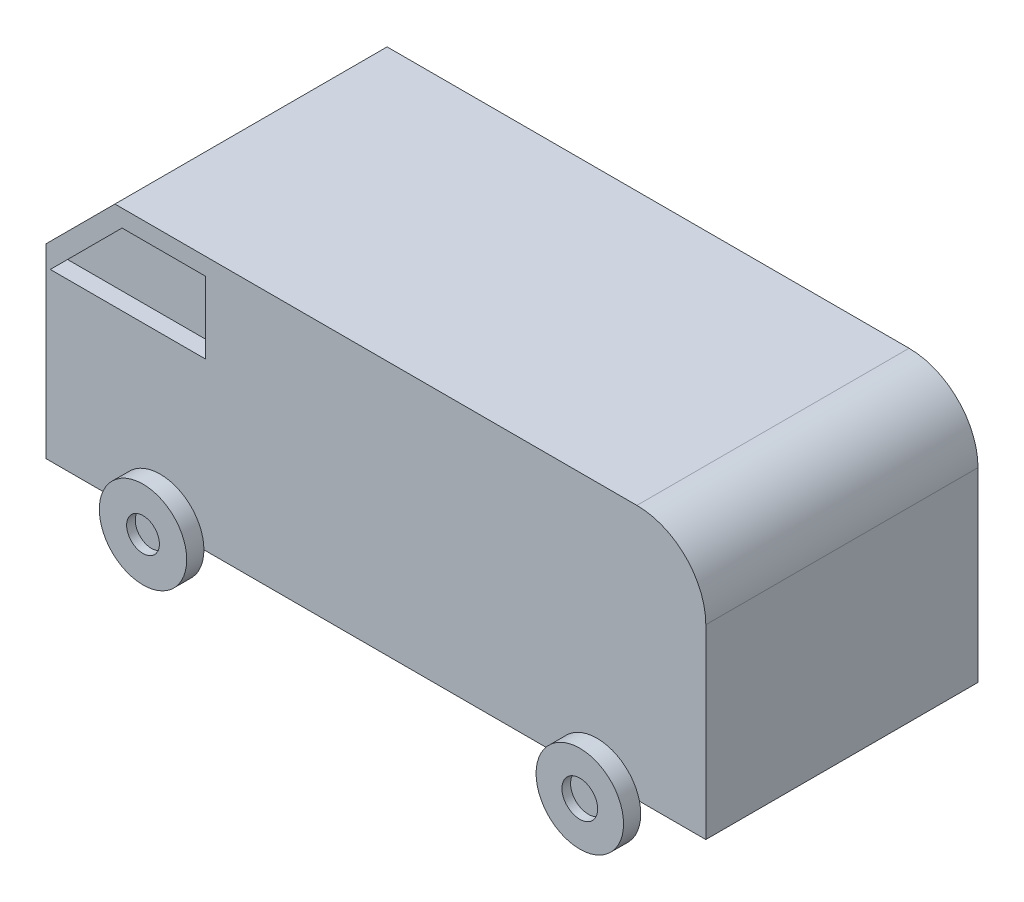
ISO-10303-21;
HEADER;
FILE_DESCRIPTION(('STEP AP214'),'2;1');
FILE_NAME('part.step','',(''),(''),'','','');
FILE_SCHEMA(('AUTOMOTIVE_DESIGN { 1 0 10303 214 1 1 1 1 }'));
ENDSEC;
DATA;
#1=APPLICATION_CONTEXT('core data for automotive mechanical design processes');
#2=APPLICATION_PROTOCOL_DEFINITION('international standard','automotive_design',2000,#1);
#3=PRODUCT_CONTEXT('',#1,'mechanical');
#4=PRODUCT('Part','Part','',(#3));
#5=PRODUCT_RELATED_PRODUCT_CATEGORY('part','',(#4));
#6=PRODUCT_DEFINITION_FORMATION('','',#4);
#7=PRODUCT_DEFINITION_CONTEXT('part definition',#1,'design');
#8=PRODUCT_DEFINITION('design','',#6,#7);
#9=PRODUCT_DEFINITION_SHAPE('','',#8);
#10=(LENGTH_UNIT() NAMED_UNIT(*) SI_UNIT(.MILLI.,.METRE.));
#11=(NAMED_UNIT(*) PLANE_ANGLE_UNIT() SI_UNIT($,.RADIAN.));
#12=(NAMED_UNIT(*) SI_UNIT($,.STERADIAN.) SOLID_ANGLE_UNIT());
#13=UNCERTAINTY_MEASURE_WITH_UNIT(LENGTH_MEASURE(1.E-05),#10,'distance_accuracy_value','');
#14=(GEOMETRIC_REPRESENTATION_CONTEXT(3) GLOBAL_UNCERTAINTY_ASSIGNED_CONTEXT((#13)) GLOBAL_UNIT_ASSIGNED_CONTEXT((#10,
#11,#12)) REPRESENTATION_CONTEXT('',''));
#15=CARTESIAN_POINT('',(0.,0.,0.));
#16=DIRECTION('',(0.,0.,1.));
#17=DIRECTION('',(1.,0.,0.));
#18=AXIS2_PLACEMENT_3D('',#15,#16,#17);
#19=CARTESIAN_POINT('',(121.13815337085,0.,89.));
#20=DIRECTION('',(0.,0.,-1.));
#21=DIRECTION('',(-1.,0.,0.));
#22=AXIS2_PLACEMENT_3D('',#19,#20,#21);
#23=CYLINDRICAL_SURFACE('',#22,0.0789375693557303);
#24=CARTESIAN_POINT('',(121.13815337085,0.,79.));
#25=DIRECTION('',(0.,0.,1.));
#26=DIRECTION('',(1.,0.,0.));
#27=AXIS2_PLACEMENT_3D('',#24,#25,#26);
#28=CIRCLE('',#27,0.0789375693557303);
#29=CARTESIAN_POINT('',(121.217090940206,0.,79.));
#30=VERTEX_POINT('',#29);
#31=CARTESIAN_POINT('',(121.059215801495,0.,79.));
#32=VERTEX_POINT('',#31);
#33=EDGE_CURVE('E190',#30,#32,#28,.T.);
#34=ORIENTED_EDGE('',*,*,#33,.F.);
#35=EDGE_CURVE('E186',#32,#30,#28,.T.);
#36=ORIENTED_EDGE('',*,*,#35,.F.);
#37=EDGE_LOOP('',(#34,#36));
#38=FACE_BOUND('',#37,.T.);
#39=CARTESIAN_POINT('',(121.13815337085,0.,84.));
#40=DIRECTION('',(0.,0.,1.));
#41=DIRECTION('',(1.,0.,0.));
#42=AXIS2_PLACEMENT_3D('',#39,#40,#41);
#43=CIRCLE('',#42,0.0789375693557303);
#44=CARTESIAN_POINT('',(121.217090940206,0.,84.));
#45=VERTEX_POINT('',#44);
#46=EDGE_CURVE('E43',#45,#45,#43,.T.);
#47=ORIENTED_EDGE('',*,*,#46,.T.);
#48=EDGE_LOOP('',(#47));
#49=FACE_BOUND('',#48,.T.);
#50=ADVANCED_FACE('F39',(#38,#49),#23,.F.);
#51=CARTESIAN_POINT('',(-191.5,148.,79.));
#52=DIRECTION('',(0.,0.,-1.));
#53=DIRECTION('',(-1.,0.,0.));
#54=AXIS2_PLACEMENT_3D('',#51,#52,#53);
#55=PLANE('',#54);
#56=DIRECTION('',(1.,0.,0.));
#57=VECTOR('',#56,1.);
#58=CARTESIAN_POINT('',(-191.5,0.,79.));
#59=LINE('',#58,#57);
#60=EDGE_CURVE('E353',#32,#30,#59,.T.);
#61=ORIENTED_EDGE('',*,*,#60,.T.);
#62=ORIENTED_EDGE('',*,*,#33,.T.);
#63=EDGE_LOOP('',(#61,#62));
#64=FACE_BOUND('',#63,.T.);
#65=ADVANCED_FACE('F401',(#64),#55,.F.);
#66=CARTESIAN_POINT('',(191.5,148.,79.));
#67=DIRECTION('',(-1.,0.,0.));
#68=DIRECTION('',(0.,0.,1.));
#69=AXIS2_PLACEMENT_3D('',#66,#67,#68);
#70=PLANE('',#69);
#71=DIRECTION('',(0.,-1.,0.));
#72=VECTOR('',#71,1.);
#73=CARTESIAN_POINT('',(191.5,148.,-79.));
#74=LINE('',#73,#72);
#75=CARTESIAN_POINT('',(191.5,108.,-79.));
#76=VERTEX_POINT('',#75);
#77=CARTESIAN_POINT('',(191.5,0.,-79.));
#78=VERTEX_POINT('',#77);
#79=EDGE_CURVE('E285',#76,#78,#74,.T.);
#80=ORIENTED_EDGE('',*,*,#79,.F.);
#81=DIRECTION('',(0.,0.,-1.));
#82=VECTOR('',#81,1.);
#83=CARTESIAN_POINT('',(191.5,108.,79.));
#84=LINE('',#83,#82);
#85=CARTESIAN_POINT('',(191.5,108.,79.));
#86=VERTEX_POINT('',#85);
#87=EDGE_CURVE('E309',#76,#86,#84,.F.);
#88=ORIENTED_EDGE('',*,*,#87,.T.);
#89=DIRECTION('',(0.,-1.,0.));
#90=VECTOR('',#89,1.);
#91=CARTESIAN_POINT('',(191.5,148.,79.));
#92=LINE('',#91,#90);
#93=CARTESIAN_POINT('',(191.5,0.,79.));
#94=VERTEX_POINT('',#93);
#95=EDGE_CURVE('E264',#86,#94,#92,.T.);
#96=ORIENTED_EDGE('',*,*,#95,.T.);
#97=DIRECTION('',(0.,0.,-1.));
#98=VECTOR('',#97,1.);
#99=CARTESIAN_POINT('',(191.5,0.,79.));
#100=LINE('',#99,#98);
#101=EDGE_CURVE('E156',#94,#78,#100,.T.);
#102=ORIENTED_EDGE('',*,*,#101,.T.);
#103=EDGE_LOOP('',(#80,#88,#96,#102));
#104=FACE_BOUND('',#103,.T.);
#105=ADVANCED_FACE('F345',(#104),#70,.F.);
#106=CARTESIAN_POINT('',(-191.5,148.,-79.));
#107=DIRECTION('',(0.,0.,1.));
#108=DIRECTION('',(1.,0.,0.));
#109=AXIS2_PLACEMENT_3D('',#106,#107,#108);
#110=PLANE('',#109);
#111=CARTESIAN_POINT('',(-116.282098448064,0.,-79.));
#112=DIRECTION('',(0.,0.,-1.));
#113=DIRECTION('',(-1.,0.,0.));
#114=AXIS2_PLACEMENT_3D('',#111,#112,#113);
#115=CIRCLE('',#114,25.1402396602186);
#116=CARTESIAN_POINT('',(-141.422338108282,0.,-79.));
#117=VERTEX_POINT('',#116);
#118=CARTESIAN_POINT('',(-91.1418587878454,0.,-79.));
#119=VERTEX_POINT('',#118);
#120=EDGE_CURVE('E160',#117,#119,#115,.T.);
#121=ORIENTED_EDGE('',*,*,#120,.F.);
#122=DIRECTION('',(-1.,0.,0.));
#123=VECTOR('',#122,1.);
#124=CARTESIAN_POINT('',(-191.5,0.,-79.));
#125=LINE('',#124,#123);
#126=CARTESIAN_POINT('',(-191.5,0.,-79.));
#127=VERTEX_POINT('',#126);
#128=EDGE_CURVE('E146',#117,#127,#125,.T.);
#129=ORIENTED_EDGE('',*,*,#128,.T.);
#130=DIRECTION('',(0.,-1.,0.));
#131=VECTOR('',#130,1.);
#132=CARTESIAN_POINT('',(-191.5,148.,-79.));
#133=LINE('',#132,#131);
#134=CARTESIAN_POINT('',(-191.5,108.,-79.));
#135=VERTEX_POINT('',#134);
#136=EDGE_CURVE('E282',#135,#127,#133,.T.);
#137=ORIENTED_EDGE('',*,*,#136,.F.);
#138=DIRECTION('',(-0.707106781186548,-0.707106781186548,0.));
#139=VECTOR('',#138,1.);
#140=CARTESIAN_POINT('',(-151.5,148.,-79.));
#141=LINE('',#140,#139);
#142=CARTESIAN_POINT('',(-151.5,148.,-79.));
#143=VERTEX_POINT('',#142);
#144=EDGE_CURVE('E298',#135,#143,#141,.F.);
#145=ORIENTED_EDGE('',*,*,#144,.T.);
#146=DIRECTION('',(-1.,0.,0.));
#147=VECTOR('',#146,1.);
#148=CARTESIAN_POINT('',(-191.5,148.,-79.));
#149=LINE('',#148,#147);
#150=CARTESIAN_POINT('',(151.5,148.,-79.));
#151=VERTEX_POINT('',#150);
#152=EDGE_CURVE('E256',#151,#143,#149,.T.);
#153=ORIENTED_EDGE('',*,*,#152,.F.);
#154=CARTESIAN_POINT('',(151.5,108.,-79.));
#155=DIRECTION('',(0.,0.,1.));
#156=DIRECTION('',(1.,0.,0.));
#157=AXIS2_PLACEMENT_3D('',#154,#155,#156);
#158=CIRCLE('',#157,40.);
#159=EDGE_CURVE('E306',#151,#76,#158,.F.);
#160=ORIENTED_EDGE('',*,*,#159,.T.);
#161=ORIENTED_EDGE('',*,*,#79,.T.);
#162=CARTESIAN_POINT('',(157.922480649683,0.,-79.));
#163=VERTEX_POINT('',#162);
#164=EDGE_CURVE('E158',#78,#163,#125,.T.);
#165=ORIENTED_EDGE('',*,*,#164,.T.);
#166=CARTESIAN_POINT('',(132.542849771646,0.,-79.));
#167=DIRECTION('',(0.,0.,-1.));
#168=DIRECTION('',(-1.,0.,0.));
#169=AXIS2_PLACEMENT_3D('',#166,#167,#168);
#170=CIRCLE('',#169,25.3796308780376);
#171=CARTESIAN_POINT('',(107.163218893608,0.,-79.));
#172=VERTEX_POINT('',#171);
#173=EDGE_CURVE('E63',#172,#163,#170,.T.);
#174=ORIENTED_EDGE('',*,*,#173,.F.);
#175=EDGE_CURVE('E162',#172,#119,#125,.T.);
#176=ORIENTED_EDGE('',*,*,#175,.T.);
#177=EDGE_LOOP('',(#121,#129,#137,#145,#153,#160,#161,#165,#174,#176));
#178=FACE_BOUND('',#177,.T.);
#179=ADVANCED_FACE('F161',(#178),#110,.F.);
#180=CARTESIAN_POINT('',(-191.5,148.,79.));
#181=DIRECTION('',(1.,0.,0.));
#182=DIRECTION('',(0.,0.,-1.));
#183=AXIS2_PLACEMENT_3D('',#180,#181,#182);
#184=PLANE('',#183);
#185=CARTESIAN_POINT('',(-191.5,34.6704726791085,30.2804457082857));
#186=DIRECTION('',(1.,0.,0.));
#187=DIRECTION('',(0.,0.,-1.));
#188=AXIS2_PLACEMENT_3D('',#185,#186,#187);
#189=CIRCLE('',#188,16.2323764534416);
#190=CARTESIAN_POINT('',(-191.5,34.6704726791085,14.0480692548441));
#191=VERTEX_POINT('',#190);
#192=EDGE_CURVE('E11',#191,#191,#189,.F.);
#193=ORIENTED_EDGE('',*,*,#192,.F.);
#194=EDGE_LOOP('',(#193));
#195=FACE_BOUND('',#194,.T.);
#196=CARTESIAN_POINT('',(-191.5,34.6704726791085,-53.7194885195902));
#197=DIRECTION('',(1.,0.,0.));
#198=DIRECTION('',(0.,0.,-1.));
#199=AXIS2_PLACEMENT_3D('',#196,#197,#198);
#200=CIRCLE('',#199,14.3227624030982);
#201=CARTESIAN_POINT('',(-191.5,34.6704726791085,-68.0422509226884));
#202=VERTEX_POINT('',#201);
#203=EDGE_CURVE('E49',#202,#202,#200,.F.);
#204=ORIENTED_EDGE('',*,*,#203,.F.);
#205=EDGE_LOOP('',(#204));
#206=FACE_BOUND('',#205,.T.);
#207=DIRECTION('',(0.,-1.,0.));
#208=VECTOR('',#207,1.);
#209=CARTESIAN_POINT('',(-191.5,148.,79.));
#210=LINE('',#209,#208);
#211=CARTESIAN_POINT('',(-191.5,108.,79.));
#212=VERTEX_POINT('',#211);
#213=CARTESIAN_POINT('',(-191.5,0.,79.));
#214=VERTEX_POINT('',#213);
#215=EDGE_CURVE('E279',#212,#214,#210,.T.);
#216=ORIENTED_EDGE('',*,*,#215,.F.);
#217=DIRECTION('',(0.,0.,-1.));
#218=VECTOR('',#217,1.);
#219=CARTESIAN_POINT('',(-191.5,108.,79.));
#220=LINE('',#219,#218);
#221=EDGE_CURVE('E295',#212,#135,#220,.T.);
#222=ORIENTED_EDGE('',*,*,#221,.T.);
#223=ORIENTED_EDGE('',*,*,#136,.T.);
#224=DIRECTION('',(0.,0.,1.));
#225=VECTOR('',#224,1.);
#226=CARTESIAN_POINT('',(-191.5,0.,79.));
#227=LINE('',#226,#225);
#228=EDGE_CURVE('E152',#127,#214,#227,.T.);
#229=ORIENTED_EDGE('',*,*,#228,.T.);
#230=EDGE_LOOP('',(#216,#222,#223,#229));
#231=FACE_BOUND('',#230,.T.);
#232=ADVANCED_FACE('F321',(#195,#206,#231),#184,.F.);
#233=CARTESIAN_POINT('',(128.35908528128,-6.01772290961608,79.));
#234=DIRECTION('',(0.,0.,1.));
#235=DIRECTION('',(1.,0.,0.));
#236=AXIS2_PLACEMENT_3D('',#233,#234,#235);
#237=CIRCLE('',#236,25.3835482797886);
#238=CARTESIAN_POINT('',(153.019002845121,0.,79.));
#239=VERTEX_POINT('',#238);
#240=CARTESIAN_POINT('',(103.699167717439,0.,79.));
#241=VERTEX_POINT('',#240);
#242=EDGE_CURVE('E200',#239,#241,#237,.T.);
#243=ORIENTED_EDGE('',*,*,#242,.F.);
#244=EDGE_CURVE('E272',#239,#94,#59,.T.);
#245=ORIENTED_EDGE('',*,*,#244,.T.);
#246=ORIENTED_EDGE('',*,*,#95,.F.);
#247=CARTESIAN_POINT('',(151.5,108.,79.));
#248=DIRECTION('',(0.,0.,-1.));
#249=DIRECTION('',(-1.,0.,0.));
#250=AXIS2_PLACEMENT_3D('',#247,#248,#249);
#251=CIRCLE('',#250,40.);
#252=CARTESIAN_POINT('',(151.5,148.,79.));
#253=VERTEX_POINT('',#252);
#254=EDGE_CURVE('E312',#86,#253,#251,.F.);
#255=ORIENTED_EDGE('',*,*,#254,.T.);
#256=DIRECTION('',(1.,0.,0.));
#257=VECTOR('',#256,1.);
#258=CARTESIAN_POINT('',(-191.5,148.,79.));
#259=LINE('',#258,#257);
#260=CARTESIAN_POINT('',(-151.5,148.,79.));
#261=VERTEX_POINT('',#260);
#262=EDGE_CURVE('E259',#261,#253,#259,.T.);
#263=ORIENTED_EDGE('',*,*,#262,.F.);
#264=DIRECTION('',(0.707106781186548,0.707106781186548,0.));
#265=VECTOR('',#264,1.);
#266=CARTESIAN_POINT('',(-151.5,148.,79.));
#267=LINE('',#266,#265);
#268=EDGE_CURVE('E292',#261,#212,#267,.F.);
#269=ORIENTED_EDGE('',*,*,#268,.T.);
#270=ORIENTED_EDGE('',*,*,#215,.T.);
#271=CARTESIAN_POINT('',(-150.549077837624,0.,79.));
#272=VERTEX_POINT('',#271);
#273=EDGE_CURVE('E260',#214,#272,#59,.T.);
#274=ORIENTED_EDGE('',*,*,#273,.T.);
#275=CARTESIAN_POINT('',(-125.190072903536,0.,79.));
#276=DIRECTION('',(0.,0.,1.));
#277=DIRECTION('',(1.,0.,0.));
#278=AXIS2_PLACEMENT_3D('',#275,#276,#277);
#279=CIRCLE('',#278,25.3590049340886);
#280=CARTESIAN_POINT('',(-99.831067969447,0.,79.));
#281=VERTEX_POINT('',#280);
#282=EDGE_CURVE('E209',#281,#272,#279,.T.);
#283=ORIENTED_EDGE('',*,*,#282,.F.);
#284=EDGE_CURVE('E364',#281,#241,#59,.T.);
#285=ORIENTED_EDGE('',*,*,#284,.T.);
#286=EDGE_LOOP('',(#243,#245,#246,#255,#263,#269,#270,#274,#283,#285));
#287=FACE_BOUND('',#286,.T.);
#288=DIRECTION('',(-1.,0.,0.));
#289=VECTOR('',#288,1.);
#290=CARTESIAN_POINT('',(0.,138.,79.));
#291=LINE('',#290,#289);
#292=CARTESIAN_POINT('',(-98.9978643762689,138.,79.));
#293=VERTEX_POINT('',#292);
#294=CARTESIAN_POINT('',(-147.357864376269,138.,79.));
#295=VERTEX_POINT('',#294);
#296=EDGE_CURVE('E233',#293,#295,#291,.T.);
#297=ORIENTED_EDGE('',*,*,#296,.F.);
#298=DIRECTION('',(0.,1.,0.));
#299=VECTOR('',#298,1.);
#300=CARTESIAN_POINT('',(-98.9978643762689,0.,79.));
#301=LINE('',#300,#299);
#302=CARTESIAN_POINT('',(-98.9978643762689,96.36,79.));
#303=VERTEX_POINT('',#302);
#304=EDGE_CURVE('E208',#303,#293,#301,.T.);
#305=ORIENTED_EDGE('',*,*,#304,.F.);
#306=DIRECTION('',(1.,0.,0.));
#307=VECTOR('',#306,1.);
#308=CARTESIAN_POINT('',(0.,96.36,79.));
#309=LINE('',#308,#307);
#310=CARTESIAN_POINT('',(-188.997864376269,96.36,79.));
#311=VERTEX_POINT('',#310);
#312=EDGE_CURVE('E218',#311,#303,#309,.T.);
#313=ORIENTED_EDGE('',*,*,#312,.F.);
#314=DIRECTION('',(-0.707106781186548,-0.707106781186548,0.));
#315=VECTOR('',#314,1.);
#316=CARTESIAN_POINT('',(-142.678932188134,142.678932188134,79.));
#317=LINE('',#316,#315);
#318=EDGE_CURVE('E237',#295,#311,#317,.T.);
#319=ORIENTED_EDGE('',*,*,#318,.F.);
#320=EDGE_LOOP('',(#297,#305,#313,#319));
#321=FACE_BOUND('',#320,.T.);
#322=ADVANCED_FACE('F324',(#287,#321),#55,.F.);
#323=CARTESIAN_POINT('',(0.,148.,0.));
#324=DIRECTION('',(0.,-1.,0.));
#325=DIRECTION('',(0.,0.,-1.));
#326=AXIS2_PLACEMENT_3D('',#323,#324,#325);
#327=PLANE('',#326);
#328=ORIENTED_EDGE('',*,*,#262,.T.);
#329=DIRECTION('',(0.,0.,-1.));
#330=VECTOR('',#329,1.);
#331=CARTESIAN_POINT('',(151.5,148.,0.));
#332=LINE('',#331,#330);
#333=EDGE_CURVE('E302',#253,#151,#332,.T.);
#334=ORIENTED_EDGE('',*,*,#333,.T.);
#335=ORIENTED_EDGE('',*,*,#152,.T.);
#336=DIRECTION('',(0.,0.,1.));
#337=VECTOR('',#336,1.);
#338=CARTESIAN_POINT('',(-151.5,148.,0.));
#339=LINE('',#338,#337);
#340=EDGE_CURVE('E288',#143,#261,#339,.T.);
#341=ORIENTED_EDGE('',*,*,#340,.T.);
#342=EDGE_LOOP('',(#328,#334,#335,#341));
#343=FACE_BOUND('',#342,.T.);
#344=ADVANCED_FACE('F337',(#343),#327,.F.);
#345=CARTESIAN_POINT('',(0.,0.,0.));
#346=DIRECTION('',(0.,-1.,0.));
#347=DIRECTION('',(0.,0.,-1.));
#348=AXIS2_PLACEMENT_3D('',#345,#346,#347);
#349=PLANE('',#348);
#350=ORIENTED_EDGE('',*,*,#101,.F.);
#351=ORIENTED_EDGE('',*,*,#244,.F.);
#352=EDGE_CURVE('E351',#30,#239,#59,.T.);
#353=ORIENTED_EDGE('',*,*,#352,.F.);
#354=ORIENTED_EDGE('',*,*,#60,.F.);
#355=EDGE_CURVE('E360',#241,#32,#59,.T.);
#356=ORIENTED_EDGE('',*,*,#355,.F.);
#357=ORIENTED_EDGE('',*,*,#284,.F.);
#358=EDGE_CURVE('E275',#272,#281,#59,.T.);
#359=ORIENTED_EDGE('',*,*,#358,.F.);
#360=ORIENTED_EDGE('',*,*,#273,.F.);
#361=ORIENTED_EDGE('',*,*,#228,.F.);
#362=ORIENTED_EDGE('',*,*,#128,.F.);
#363=EDGE_CURVE('E56',#119,#117,#125,.T.);
#364=ORIENTED_EDGE('',*,*,#363,.F.);
#365=ORIENTED_EDGE('',*,*,#175,.F.);
#366=EDGE_CURVE('E269',#163,#172,#125,.T.);
#367=ORIENTED_EDGE('',*,*,#366,.F.);
#368=ORIENTED_EDGE('',*,*,#164,.F.);
#369=EDGE_LOOP('',(#350,#351,#353,#354,#356,#357,#359,#360,#361,#362,#364,#365,#367,#368));
#370=FACE_BOUND('',#369,.T.);
#371=ADVANCED_FACE('F149',(#370),#349,.T.);
#372=CARTESIAN_POINT('',(-151.5,148.,0.));
#373=DIRECTION('',(0.707106781186548,-0.707106781186548,0.));
#374=DIRECTION('',(0.,0.,1.));
#375=AXIS2_PLACEMENT_3D('',#372,#373,#374);
#376=PLANE('',#375);
#377=ORIENTED_EDGE('',*,*,#144,.F.);
#378=ORIENTED_EDGE('',*,*,#221,.F.);
#379=ORIENTED_EDGE('',*,*,#268,.F.);
#380=ORIENTED_EDGE('',*,*,#340,.F.);
#381=EDGE_LOOP('',(#377,#378,#379,#380));
#382=FACE_BOUND('',#381,.T.);
#383=ADVANCED_FACE('F332',(#382),#376,.F.);
#384=CARTESIAN_POINT('',(151.5,108.,0.));
#385=DIRECTION('',(0.,0.,-1.));
#386=DIRECTION('',(-1.,0.,0.));
#387=AXIS2_PLACEMENT_3D('',#384,#385,#386);
#388=CYLINDRICAL_SURFACE('',#387,40.);
#389=ORIENTED_EDGE('',*,*,#254,.F.);
#390=ORIENTED_EDGE('',*,*,#87,.F.);
#391=ORIENTED_EDGE('',*,*,#159,.F.);
#392=ORIENTED_EDGE('',*,*,#333,.F.);
#393=EDGE_LOOP('',(#389,#390,#391,#392));
#394=FACE_BOUND('',#393,.T.);
#395=ADVANCED_FACE('F41',(#394),#388,.T.);
#396=CARTESIAN_POINT('',(-98.9978643762689,0.,69.));
#397=DIRECTION('',(1.,0.,0.));
#398=DIRECTION('',(0.,0.,-1.));
#399=AXIS2_PLACEMENT_3D('',#396,#397,#398);
#400=PLANE('',#399);
#401=ORIENTED_EDGE('',*,*,#304,.T.);
#402=DIRECTION('',(0.,0.,1.));
#403=VECTOR('',#402,1.);
#404=CARTESIAN_POINT('',(-98.9978643762689,138.,69.));
#405=LINE('',#404,#403);
#406=CARTESIAN_POINT('',(-98.9978643762689,138.,69.));
#407=VERTEX_POINT('',#406);
#408=EDGE_CURVE('E230',#407,#293,#405,.T.);
#409=ORIENTED_EDGE('',*,*,#408,.F.);
#410=DIRECTION('',(0.,1.,0.));
#411=VECTOR('',#410,1.);
#412=CARTESIAN_POINT('',(-98.9978643762689,0.,69.));
#413=LINE('',#412,#411);
#414=CARTESIAN_POINT('',(-98.9978643762689,96.36,69.));
#415=VERTEX_POINT('',#414);
#416=EDGE_CURVE('E213',#415,#407,#413,.T.);
#417=ORIENTED_EDGE('',*,*,#416,.F.);
#418=DIRECTION('',(0.,0.,1.));
#419=VECTOR('',#418,1.);
#420=CARTESIAN_POINT('',(-98.9978643762689,96.36,69.));
#421=LINE('',#420,#419);
#422=EDGE_CURVE('E244',#415,#303,#421,.T.);
#423=ORIENTED_EDGE('',*,*,#422,.T.);
#424=EDGE_LOOP('',(#401,#409,#417,#423));
#425=FACE_BOUND('',#424,.T.);
#426=ADVANCED_FACE('F445',(#425),#400,.F.);
#427=CARTESIAN_POINT('',(0.,96.36,69.));
#428=DIRECTION('',(0.,-1.,0.));
#429=DIRECTION('',(0.,0.,-1.));
#430=AXIS2_PLACEMENT_3D('',#427,#428,#429);
#431=PLANE('',#430);
#432=ORIENTED_EDGE('',*,*,#312,.T.);
#433=ORIENTED_EDGE('',*,*,#422,.F.);
#434=DIRECTION('',(1.,0.,0.));
#435=VECTOR('',#434,1.);
#436=CARTESIAN_POINT('',(0.,96.36,69.));
#437=LINE('',#436,#435);
#438=CARTESIAN_POINT('',(-188.997864376269,96.36,69.));
#439=VERTEX_POINT('',#438);
#440=EDGE_CURVE('E226',#439,#415,#437,.T.);
#441=ORIENTED_EDGE('',*,*,#440,.F.);
#442=DIRECTION('',(0.,0.,1.));
#443=VECTOR('',#442,1.);
#444=CARTESIAN_POINT('',(-188.997864376269,96.36,69.));
#445=LINE('',#444,#443);
#446=EDGE_CURVE('E247',#439,#311,#445,.T.);
#447=ORIENTED_EDGE('',*,*,#446,.T.);
#448=EDGE_LOOP('',(#432,#433,#441,#447));
#449=FACE_BOUND('',#448,.T.);
#450=ADVANCED_FACE('F441',(#449),#431,.F.);
#451=CARTESIAN_POINT('',(-142.678932188134,142.678932188134,69.));
#452=DIRECTION('',(-0.707106781186548,0.707106781186548,0.));
#453=DIRECTION('',(-0.707106781186548,-0.707106781186548,0.));
#454=AXIS2_PLACEMENT_3D('',#451,#452,#453);
#455=PLANE('',#454);
#456=ORIENTED_EDGE('',*,*,#318,.T.);
#457=ORIENTED_EDGE('',*,*,#446,.F.);
#458=DIRECTION('',(-0.707106781186548,-0.707106781186548,0.));
#459=VECTOR('',#458,1.);
#460=CARTESIAN_POINT('',(-142.678932188134,142.678932188134,69.));
#461=LINE('',#460,#459);
#462=CARTESIAN_POINT('',(-147.357864376269,138.,69.));
#463=VERTEX_POINT('',#462);
#464=EDGE_CURVE('E222',#463,#439,#461,.T.);
#465=ORIENTED_EDGE('',*,*,#464,.F.);
#466=DIRECTION('',(0.,0.,1.));
#467=VECTOR('',#466,1.);
#468=CARTESIAN_POINT('',(-147.357864376269,138.,69.));
#469=LINE('',#468,#467);
#470=EDGE_CURVE('E250',#463,#295,#469,.T.);
#471=ORIENTED_EDGE('',*,*,#470,.T.);
#472=EDGE_LOOP('',(#456,#457,#465,#471));
#473=FACE_BOUND('',#472,.T.);
#474=ADVANCED_FACE('F444',(#473),#455,.F.);
#475=CARTESIAN_POINT('',(0.,138.,69.));
#476=DIRECTION('',(0.,1.,0.));
#477=DIRECTION('',(0.,0.,1.));
#478=AXIS2_PLACEMENT_3D('',#475,#476,#477);
#479=PLANE('',#478);
#480=ORIENTED_EDGE('',*,*,#296,.T.);
#481=ORIENTED_EDGE('',*,*,#470,.F.);
#482=DIRECTION('',(-1.,0.,0.));
#483=VECTOR('',#482,1.);
#484=CARTESIAN_POINT('',(0.,138.,69.));
#485=LINE('',#484,#483);
#486=EDGE_CURVE('E217',#407,#463,#485,.T.);
#487=ORIENTED_EDGE('',*,*,#486,.F.);
#488=ORIENTED_EDGE('',*,*,#408,.T.);
#489=EDGE_LOOP('',(#480,#481,#487,#488));
#490=FACE_BOUND('',#489,.T.);
#491=ADVANCED_FACE('F439',(#490),#479,.F.);
#492=CARTESIAN_POINT('',(0.,0.,69.));
#493=DIRECTION('',(0.,0.,1.));
#494=DIRECTION('',(1.,0.,0.));
#495=AXIS2_PLACEMENT_3D('',#492,#493,#494);
#496=PLANE('',#495);
#497=ORIENTED_EDGE('',*,*,#416,.T.);
#498=ORIENTED_EDGE('',*,*,#486,.T.);
#499=ORIENTED_EDGE('',*,*,#464,.T.);
#500=ORIENTED_EDGE('',*,*,#440,.T.);
#501=EDGE_LOOP('',(#497,#498,#499,#500));
#502=FACE_BOUND('',#501,.T.);
#503=ADVANCED_FACE('F433',(#502),#496,.T.);
#504=CARTESIAN_POINT('',(-125.190072903536,0.,79.));
#505=DIRECTION('',(0.,0.,1.));
#506=DIRECTION('',(1.,0.,0.));
#507=AXIS2_PLACEMENT_3D('',#504,#505,#506);
#508=PLANE('',#507);
#509=EDGE_CURVE('E199',#272,#281,#279,.T.);
#510=ORIENTED_EDGE('',*,*,#509,.F.);
#511=ORIENTED_EDGE('',*,*,#358,.T.);
#512=EDGE_LOOP('',(#510,#511));
#513=FACE_BOUND('',#512,.T.);
#514=ADVANCED_FACE('F374',(#513),#508,.F.);
#515=CARTESIAN_POINT('',(-125.190072903536,0.,89.));
#516=DIRECTION('',(0.,0.,-1.));
#517=DIRECTION('',(-1.,0.,0.));
#518=AXIS2_PLACEMENT_3D('',#515,#516,#517);
#519=CYLINDRICAL_SURFACE('',#518,25.3590049340886);
#520=CARTESIAN_POINT('',(-125.190072903536,0.,89.));
#521=DIRECTION('',(0.,0.,1.));
#522=DIRECTION('',(1.,0.,0.));
#523=AXIS2_PLACEMENT_3D('',#520,#521,#522);
#524=CIRCLE('',#523,25.3590049340886);
#525=CARTESIAN_POINT('',(-99.831067969447,0.,89.));
#526=VERTEX_POINT('',#525);
#527=EDGE_CURVE('E204',#526,#526,#524,.T.);
#528=ORIENTED_EDGE('',*,*,#527,.F.);
#529=EDGE_LOOP('',(#528));
#530=FACE_BOUND('',#529,.T.);
#531=ORIENTED_EDGE('',*,*,#282,.T.);
#532=ORIENTED_EDGE('',*,*,#509,.T.);
#533=EDGE_LOOP('',(#531,#532));
#534=FACE_BOUND('',#533,.T.);
#535=ADVANCED_FACE('F376',(#530,#534),#519,.T.);
#536=CARTESIAN_POINT('',(-125.190072903536,0.,89.));
#537=DIRECTION('',(0.,0.,1.));
#538=DIRECTION('',(1.,0.,0.));
#539=AXIS2_PLACEMENT_3D('',#536,#537,#538);
#540=PLANE('',#539);
#541=CARTESIAN_POINT('',(-125.190072903536,0.,89.));
#542=DIRECTION('',(0.,0.,1.));
#543=DIRECTION('',(1.,0.,0.));
#544=AXIS2_PLACEMENT_3D('',#541,#542,#543);
#545=CIRCLE('',#544,9.52026744639056);
#546=CARTESIAN_POINT('',(-115.669805457145,0.,89.));
#547=VERTEX_POINT('',#546);
#548=EDGE_CURVE('E637',#547,#547,#545,.T.);
#549=ORIENTED_EDGE('',*,*,#548,.F.);
#550=EDGE_LOOP('',(#549));
#551=FACE_BOUND('',#550,.T.);
#552=ORIENTED_EDGE('',*,*,#527,.T.);
#553=EDGE_LOOP('',(#552));
#554=FACE_BOUND('',#553,.T.);
#555=ADVANCED_FACE('F419',(#551,#554),#540,.T.);
#556=CARTESIAN_POINT('',(128.35908528128,-6.01772290961608,89.));
#557=DIRECTION('',(0.,0.,1.));
#558=DIRECTION('',(1.,0.,0.));
#559=AXIS2_PLACEMENT_3D('',#556,#557,#558);
#560=PLANE('',#559);
#561=CARTESIAN_POINT('',(128.35908528128,-6.01772290961608,89.));
#562=DIRECTION('',(0.,0.,1.));
#563=DIRECTION('',(1.,0.,0.));
#564=AXIS2_PLACEMENT_3D('',#561,#562,#563);
#565=CIRCLE('',#564,10.3671035199517);
#566=CARTESIAN_POINT('',(138.726188801232,-6.01772290961608,89.));
#567=VERTEX_POINT('',#566);
#568=EDGE_CURVE('E649',#567,#567,#565,.T.);
#569=ORIENTED_EDGE('',*,*,#568,.F.);
#570=EDGE_LOOP('',(#569));
#571=FACE_BOUND('',#570,.T.);
#572=CARTESIAN_POINT('',(128.35908528128,-6.01772290961608,89.));
#573=DIRECTION('',(0.,0.,1.));
#574=DIRECTION('',(1.,0.,0.));
#575=AXIS2_PLACEMENT_3D('',#572,#573,#574);
#576=CIRCLE('',#575,25.3835482797886);
#577=CARTESIAN_POINT('',(153.742633561069,-6.01772290961608,89.));
#578=VERTEX_POINT('',#577);
#579=EDGE_CURVE('E195',#578,#578,#576,.T.);
#580=ORIENTED_EDGE('',*,*,#579,.T.);
#581=EDGE_LOOP('',(#580));
#582=FACE_BOUND('',#581,.T.);
#583=ADVANCED_FACE('F415',(#571,#582),#560,.T.);
#584=CARTESIAN_POINT('',(128.35908528128,-6.01772290961608,79.));
#585=DIRECTION('',(0.,0.,1.));
#586=DIRECTION('',(1.,0.,0.));
#587=AXIS2_PLACEMENT_3D('',#584,#585,#586);
#588=PLANE('',#587);
#589=ORIENTED_EDGE('',*,*,#352,.T.);
#590=EDGE_CURVE('E194',#241,#239,#237,.T.);
#591=ORIENTED_EDGE('',*,*,#590,.F.);
#592=ORIENTED_EDGE('',*,*,#355,.T.);
#593=ORIENTED_EDGE('',*,*,#35,.T.);
#594=EDGE_LOOP('',(#589,#591,#592,#593));
#595=FACE_BOUND('',#594,.T.);
#596=ADVANCED_FACE('F418',(#595),#588,.F.);
#597=CARTESIAN_POINT('',(128.35908528128,-6.01772290961608,89.));
#598=DIRECTION('',(0.,0.,-1.));
#599=DIRECTION('',(-1.,0.,0.));
#600=AXIS2_PLACEMENT_3D('',#597,#598,#599);
#601=CYLINDRICAL_SURFACE('',#600,25.3835482797886);
#602=ORIENTED_EDGE('',*,*,#579,.F.);
#603=EDGE_LOOP('',(#602));
#604=FACE_BOUND('',#603,.T.);
#605=ORIENTED_EDGE('',*,*,#242,.T.);
#606=ORIENTED_EDGE('',*,*,#590,.T.);
#607=EDGE_LOOP('',(#605,#606));
#608=FACE_BOUND('',#607,.T.);
#609=ADVANCED_FACE('F423',(#604,#608),#601,.T.);
#610=CARTESIAN_POINT('',(132.542849771646,0.,-79.));
#611=DIRECTION('',(0.,0.,-1.));
#612=DIRECTION('',(-1.,0.,0.));
#613=AXIS2_PLACEMENT_3D('',#610,#611,#612);
#614=PLANE('',#613);
#615=EDGE_CURVE('E189',#163,#172,#170,.T.);
#616=ORIENTED_EDGE('',*,*,#615,.F.);
#617=ORIENTED_EDGE('',*,*,#366,.T.);
#618=EDGE_LOOP('',(#616,#617));
#619=FACE_BOUND('',#618,.T.);
#620=ADVANCED_FACE('F426',(#619),#614,.F.);
#621=CARTESIAN_POINT('',(132.542849771646,0.,-89.));
#622=DIRECTION('',(0.,0.,1.));
#623=DIRECTION('',(1.,0.,0.));
#624=AXIS2_PLACEMENT_3D('',#621,#622,#623);
#625=CYLINDRICAL_SURFACE('',#624,25.3796308780376);
#626=CARTESIAN_POINT('',(132.542849771646,0.,-89.));
#627=DIRECTION('',(0.,0.,-1.));
#628=DIRECTION('',(-1.,0.,0.));
#629=AXIS2_PLACEMENT_3D('',#626,#627,#628);
#630=CIRCLE('',#629,25.3796308780376);
#631=CARTESIAN_POINT('',(107.163218893608,0.,-89.));
#632=VERTEX_POINT('',#631);
#633=EDGE_CURVE('E182',#632,#632,#630,.T.);
#634=ORIENTED_EDGE('',*,*,#633,.F.);
#635=EDGE_LOOP('',(#634));
#636=FACE_BOUND('',#635,.T.);
#637=ORIENTED_EDGE('',*,*,#173,.T.);
#638=ORIENTED_EDGE('',*,*,#615,.T.);
#639=EDGE_LOOP('',(#637,#638));
#640=FACE_BOUND('',#639,.T.);
#641=ADVANCED_FACE('F396',(#636,#640),#625,.T.);
#642=CARTESIAN_POINT('',(132.542849771646,0.,-89.));
#643=DIRECTION('',(0.,0.,-1.));
#644=DIRECTION('',(-1.,0.,0.));
#645=AXIS2_PLACEMENT_3D('',#642,#643,#644);
#646=PLANE('',#645);
#647=ORIENTED_EDGE('',*,*,#633,.T.);
#648=EDGE_LOOP('',(#647));
#649=FACE_BOUND('',#648,.T.);
#650=ADVANCED_FACE('F389',(#649),#646,.T.);
#651=CARTESIAN_POINT('',(-116.282098448064,0.,-89.));
#652=DIRECTION('',(0.,0.,1.));
#653=DIRECTION('',(1.,0.,0.));
#654=AXIS2_PLACEMENT_3D('',#651,#652,#653);
#655=CYLINDRICAL_SURFACE('',#654,25.1402396602186);
#656=CARTESIAN_POINT('',(-116.282098448064,0.,-89.));
#657=DIRECTION('',(0.,0.,-1.));
#658=DIRECTION('',(-1.,0.,0.));
#659=AXIS2_PLACEMENT_3D('',#656,#657,#658);
#660=CIRCLE('',#659,25.1402396602186);
#661=CARTESIAN_POINT('',(-141.422338108282,0.,-89.));
#662=VERTEX_POINT('',#661);
#663=EDGE_CURVE('E167',#662,#662,#660,.T.);
#664=ORIENTED_EDGE('',*,*,#663,.F.);
#665=EDGE_LOOP('',(#664));
#666=FACE_BOUND('',#665,.T.);
#667=ORIENTED_EDGE('',*,*,#120,.T.);
#668=EDGE_CURVE('E168',#119,#117,#115,.T.);
#669=ORIENTED_EDGE('',*,*,#668,.T.);
#670=EDGE_LOOP('',(#667,#669));
#671=FACE_BOUND('',#670,.T.);
#672=ADVANCED_FACE('F173',(#666,#671),#655,.T.);
#673=CARTESIAN_POINT('',(-116.282098448064,0.,-89.));
#674=DIRECTION('',(0.,0.,-1.));
#675=DIRECTION('',(-1.,0.,0.));
#676=AXIS2_PLACEMENT_3D('',#673,#674,#675);
#677=PLANE('',#676);
#678=ORIENTED_EDGE('',*,*,#663,.T.);
#679=EDGE_LOOP('',(#678));
#680=FACE_BOUND('',#679,.T.);
#681=ADVANCED_FACE('F386',(#680),#677,.T.);
#682=CARTESIAN_POINT('',(-116.282098448064,0.,-79.));
#683=DIRECTION('',(0.,0.,-1.));
#684=DIRECTION('',(-1.,0.,0.));
#685=AXIS2_PLACEMENT_3D('',#682,#683,#684);
#686=PLANE('',#685);
#687=ORIENTED_EDGE('',*,*,#363,.T.);
#688=ORIENTED_EDGE('',*,*,#668,.F.);
#689=EDGE_LOOP('',(#687,#688));
#690=FACE_BOUND('',#689,.T.);
#691=ADVANCED_FACE('F171',(#690),#686,.F.);
#692=CARTESIAN_POINT('',(-201.5,34.6704726791085,-53.7194885195902));
#693=DIRECTION('',(1.,0.,0.));
#694=DIRECTION('',(0.,0.,-1.));
#695=AXIS2_PLACEMENT_3D('',#692,#693,#694);
#696=CYLINDRICAL_SURFACE('',#695,14.3227624030982);
#697=CARTESIAN_POINT('',(-201.5,34.6704726791085,-53.7194885195902));
#698=DIRECTION('',(-1.,0.,0.));
#699=DIRECTION('',(0.,0.,1.));
#700=AXIS2_PLACEMENT_3D('',#697,#698,#699);
#701=CIRCLE('',#700,14.3227624030982);
#702=CARTESIAN_POINT('',(-201.5,34.6704726791085,-39.3967261164919));
#703=VERTEX_POINT('',#702);
#704=EDGE_CURVE('E175',#703,#703,#701,.T.);
#705=ORIENTED_EDGE('',*,*,#704,.F.);
#706=EDGE_LOOP('',(#705));
#707=FACE_BOUND('',#706,.T.);
#708=ORIENTED_EDGE('',*,*,#203,.T.);
#709=EDGE_LOOP('',(#708));
#710=FACE_BOUND('',#709,.T.);
#711=ADVANCED_FACE('F319',(#707,#710),#696,.T.);
#712=CARTESIAN_POINT('',(-201.5,34.6704726791085,-53.7194885195902));
#713=DIRECTION('',(-1.,0.,0.));
#714=DIRECTION('',(0.,0.,1.));
#715=AXIS2_PLACEMENT_3D('',#712,#713,#714);
#716=PLANE('',#715);
#717=ORIENTED_EDGE('',*,*,#704,.T.);
#718=EDGE_LOOP('',(#717));
#719=FACE_BOUND('',#718,.T.);
#720=ADVANCED_FACE('F555',(#719),#716,.T.);
#721=CARTESIAN_POINT('',(-201.5,34.6704726791085,30.2804457082857));
#722=DIRECTION('',(1.,0.,0.));
#723=DIRECTION('',(0.,0.,-1.));
#724=AXIS2_PLACEMENT_3D('',#721,#722,#723);
#725=CYLINDRICAL_SURFACE('',#724,16.2323764534416);
#726=CARTESIAN_POINT('',(-201.5,34.6704726791085,30.2804457082857));
#727=DIRECTION('',(-1.,0.,0.));
#728=DIRECTION('',(0.,0.,1.));
#729=AXIS2_PLACEMENT_3D('',#726,#727,#728);
#730=CIRCLE('',#729,16.2323764534416);
#731=CARTESIAN_POINT('',(-201.5,34.6704726791085,46.5128221617273));
#732=VERTEX_POINT('',#731);
#733=EDGE_CURVE('E178',#732,#732,#730,.T.);
#734=ORIENTED_EDGE('',*,*,#733,.F.);
#735=EDGE_LOOP('',(#734));
#736=FACE_BOUND('',#735,.T.);
#737=ORIENTED_EDGE('',*,*,#192,.T.);
#738=EDGE_LOOP('',(#737));
#739=FACE_BOUND('',#738,.T.);
#740=ADVANCED_FACE('F564',(#736,#739),#725,.T.);
#741=CARTESIAN_POINT('',(-201.5,34.6704726791085,30.2804457082857));
#742=DIRECTION('',(-1.,0.,0.));
#743=DIRECTION('',(0.,0.,1.));
#744=AXIS2_PLACEMENT_3D('',#741,#742,#743);
#745=PLANE('',#744);
#746=ORIENTED_EDGE('',*,*,#733,.T.);
#747=EDGE_LOOP('',(#746));
#748=FACE_BOUND('',#747,.T.);
#749=ADVANCED_FACE('F573',(#748),#745,.T.);
#750=CARTESIAN_POINT('',(128.35908528128,-6.01772290961608,84.));
#751=DIRECTION('',(0.,0.,1.));
#752=DIRECTION('',(1.,0.,0.));
#753=AXIS2_PLACEMENT_3D('',#750,#751,#752);
#754=CYLINDRICAL_SURFACE('',#753,10.3671035199517);
#755=CARTESIAN_POINT('',(128.35908528128,-6.01772290961608,84.));
#756=DIRECTION('',(0.,0.,1.));
#757=DIRECTION('',(1.,0.,0.));
#758=AXIS2_PLACEMENT_3D('',#755,#756,#757);
#759=CIRCLE('',#758,10.3671035199517);
#760=CARTESIAN_POINT('',(138.726188801232,-6.01772290961608,84.));
#761=VERTEX_POINT('',#760);
#762=EDGE_CURVE('E643',#761,#761,#759,.T.);
#763=ORIENTED_EDGE('',*,*,#762,.F.);
#764=EDGE_LOOP('',(#763));
#765=FACE_BOUND('',#764,.T.);
#766=ORIENTED_EDGE('',*,*,#568,.T.);
#767=EDGE_LOOP('',(#766));
#768=FACE_BOUND('',#767,.T.);
#769=ADVANCED_FACE('F582',(#765,#768),#754,.F.);
#770=CARTESIAN_POINT('',(128.35908528128,-6.01772290961608,84.));
#771=DIRECTION('',(0.,0.,1.));
#772=DIRECTION('',(1.,0.,0.));
#773=AXIS2_PLACEMENT_3D('',#770,#771,#772);
#774=PLANE('',#773);
#775=ORIENTED_EDGE('',*,*,#46,.F.);
#776=EDGE_LOOP('',(#775));
#777=FACE_BOUND('',#776,.T.);
#778=ORIENTED_EDGE('',*,*,#762,.T.);
#779=EDGE_LOOP('',(#778));
#780=FACE_BOUND('',#779,.T.);
#781=ADVANCED_FACE('F594',(#777,#780),#774,.T.);
#782=CARTESIAN_POINT('',(-125.190072903536,0.,84.));
#783=DIRECTION('',(0.,0.,1.));
#784=DIRECTION('',(1.,0.,0.));
#785=AXIS2_PLACEMENT_3D('',#782,#783,#784);
#786=CYLINDRICAL_SURFACE('',#785,9.52026744639056);
#787=CARTESIAN_POINT('',(-125.190072903536,0.,84.));
#788=DIRECTION('',(0.,0.,1.));
#789=DIRECTION('',(1.,0.,0.));
#790=AXIS2_PLACEMENT_3D('',#787,#788,#789);
#791=CIRCLE('',#790,9.52026744639056);
#792=CARTESIAN_POINT('',(-115.669805457145,0.,84.));
#793=VERTEX_POINT('',#792);
#794=EDGE_CURVE('E635',#793,#793,#791,.T.);
#795=ORIENTED_EDGE('',*,*,#794,.F.);
#796=EDGE_LOOP('',(#795));
#797=FACE_BOUND('',#796,.T.);
#798=ORIENTED_EDGE('',*,*,#548,.T.);
#799=EDGE_LOOP('',(#798));
#800=FACE_BOUND('',#799,.T.);
#801=ADVANCED_FACE('F603',(#797,#800),#786,.F.);
#802=CARTESIAN_POINT('',(-125.190072903536,0.,84.));
#803=DIRECTION('',(0.,0.,1.));
#804=DIRECTION('',(1.,0.,0.));
#805=AXIS2_PLACEMENT_3D('',#802,#803,#804);
#806=PLANE('',#805);
#807=ORIENTED_EDGE('',*,*,#794,.T.);
#808=EDGE_LOOP('',(#807));
#809=FACE_BOUND('',#808,.T.);
#810=ADVANCED_FACE('F612',(#809),#806,.T.);
#811=CLOSED_SHELL('',(#50,#65,#105,#179,#232,#322,#344,#371,#383,#395,#426,#450,#474,#491,#503,
#514,#535,#555,#583,#596,#609,#620,#641,#650,#672,#681,#691,#711,#720,#740,#749,#769,#781,#801,#810));
#812=MANIFOLD_SOLID_BREP('B2',#811);
#813=ADVANCED_BREP_SHAPE_REPRESENTATION('',(#18,#812),#14);
#814=SHAPE_DEFINITION_REPRESENTATION(#9,#813);
ENDSEC;
END-ISO-10303-21;
